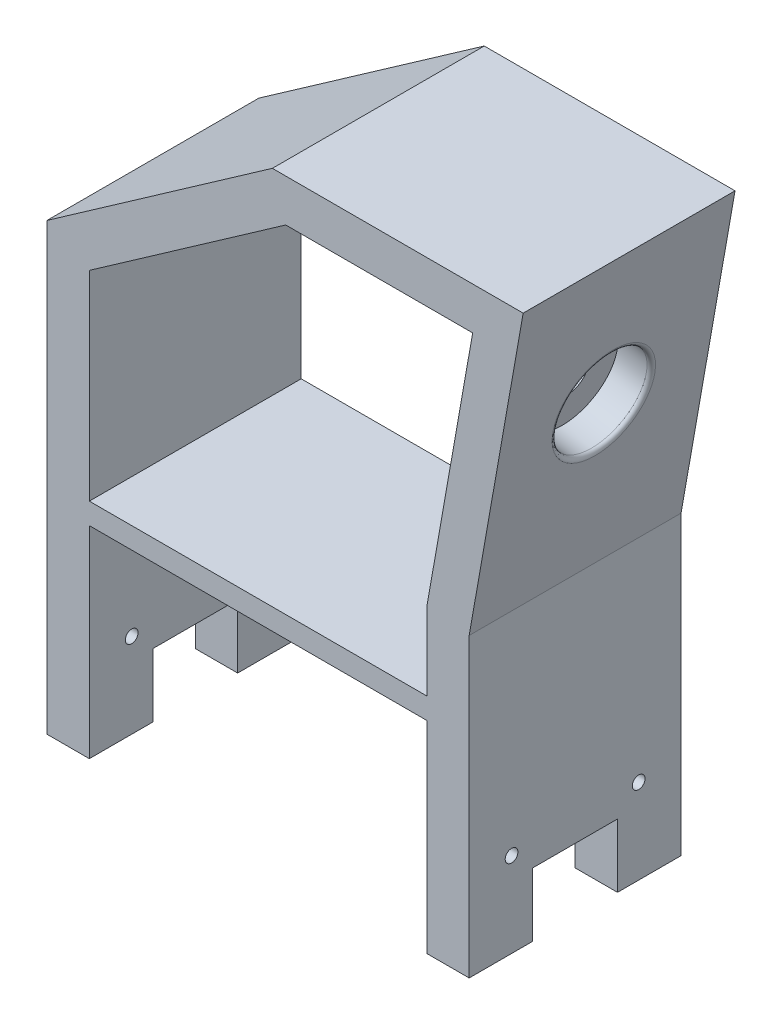
ISO-10303-21;
HEADER;
FILE_DESCRIPTION(('STEP AP214'),'2;1');
FILE_NAME('part.step','',(''),(''),'','','');
FILE_SCHEMA(('AUTOMOTIVE_DESIGN { 1 0 10303 214 1 1 1 1 }'));
ENDSEC;
DATA;
#1=APPLICATION_CONTEXT('core data for automotive mechanical design processes');
#2=APPLICATION_PROTOCOL_DEFINITION('international standard','automotive_design',2000,#1);
#3=PRODUCT_CONTEXT('',#1,'mechanical');
#4=PRODUCT('Part','Part','',(#3));
#5=PRODUCT_RELATED_PRODUCT_CATEGORY('part','',(#4));
#6=PRODUCT_DEFINITION_FORMATION('','',#4);
#7=PRODUCT_DEFINITION_CONTEXT('part definition',#1,'design');
#8=PRODUCT_DEFINITION('design','',#6,#7);
#9=PRODUCT_DEFINITION_SHAPE('','',#8);
#10=(LENGTH_UNIT() NAMED_UNIT(*) SI_UNIT(.MILLI.,.METRE.));
#11=(NAMED_UNIT(*) PLANE_ANGLE_UNIT() SI_UNIT($,.RADIAN.));
#12=(NAMED_UNIT(*) SI_UNIT($,.STERADIAN.) SOLID_ANGLE_UNIT());
#13=UNCERTAINTY_MEASURE_WITH_UNIT(LENGTH_MEASURE(1.E-05),#10,'distance_accuracy_value','');
#14=(GEOMETRIC_REPRESENTATION_CONTEXT(3) GLOBAL_UNCERTAINTY_ASSIGNED_CONTEXT((#13)) GLOBAL_UNIT_ASSIGNED_CONTEXT((#10,
#11,#12)) REPRESENTATION_CONTEXT('',''));
#15=CARTESIAN_POINT('',(0.,0.,0.));
#16=DIRECTION('',(0.,0.,1.));
#17=DIRECTION('',(1.,0.,0.));
#18=AXIS2_PLACEMENT_3D('',#15,#16,#17);
#19=CARTESIAN_POINT('',(71.8800104345077,105.,35.));
#20=DIRECTION('',(0.,-1.,0.));
#21=DIRECTION('',(1.,0.,0.));
#22=AXIS2_PLACEMENT_3D('',#19,#20,#21);
#23=PLANE('',#22);
#24=DIRECTION('',(0.,0.,-1.));
#25=VECTOR('',#24,1.);
#26=CARTESIAN_POINT('',(-30.5064857593433,105.,50.));
#27=LINE('',#26,#25);
#28=CARTESIAN_POINT('',(-30.5064857593433,105.,50.));
#29=VERTEX_POINT('',#28);
#30=CARTESIAN_POINT('',(-30.5064857593433,105.,35.));
#31=VERTEX_POINT('',#30);
#32=EDGE_CURVE('E357',#29,#31,#27,.T.);
#33=ORIENTED_EDGE('',*,*,#32,.F.);
#34=DIRECTION('',(1.,0.,0.));
#35=VECTOR('',#34,1.);
#36=CARTESIAN_POINT('',(0.,105.,50.));
#37=LINE('',#36,#35);
#38=CARTESIAN_POINT('',(-40.5064857593433,105.,50.));
#39=VERTEX_POINT('',#38);
#40=EDGE_CURVE('E356',#39,#29,#37,.T.);
#41=ORIENTED_EDGE('',*,*,#40,.F.);
#42=DIRECTION('',(0.,0.,-1.));
#43=VECTOR('',#42,1.);
#44=CARTESIAN_POINT('',(-40.5064857593433,105.,50.));
#45=LINE('',#44,#43);
#46=CARTESIAN_POINT('',(-40.5064857593433,105.,35.));
#47=VERTEX_POINT('',#46);
#48=EDGE_CURVE('E233',#39,#47,#45,.T.);
#49=ORIENTED_EDGE('',*,*,#48,.T.);
#50=DIRECTION('',(-1.,0.,0.));
#51=VECTOR('',#50,1.);
#52=CARTESIAN_POINT('',(71.8800104345077,105.,35.));
#53=LINE('',#52,#51);
#54=EDGE_CURVE('E11',#31,#47,#53,.T.);
#55=ORIENTED_EDGE('',*,*,#54,.F.);
#56=EDGE_LOOP('',(#33,#41,#49,#55));
#57=FACE_BOUND('',#56,.T.);
#58=ADVANCED_FACE('F40',(#57),#23,.T.);
#59=CARTESIAN_POINT('',(71.8800104345077,120.,35.));
#60=DIRECTION('',(0.,0.,-1.));
#61=DIRECTION('',(-1.,0.,0.));
#62=AXIS2_PLACEMENT_3D('',#59,#60,#61);
#63=PLANE('',#62);
#64=DIRECTION('',(0.,1.,0.));
#65=VECTOR('',#64,1.);
#66=CARTESIAN_POINT('',(-30.5064857593433,204.794329494483,35.));
#67=LINE('',#66,#65);
#68=CARTESIAN_POINT('',(-30.5064857593433,120.,35.));
#69=VERTEX_POINT('',#68);
#70=EDGE_CURVE('E360',#31,#69,#67,.T.);
#71=ORIENTED_EDGE('',*,*,#70,.F.);
#72=ORIENTED_EDGE('',*,*,#54,.T.);
#73=DIRECTION('',(0.,1.,0.));
#74=VECTOR('',#73,1.);
#75=CARTESIAN_POINT('',(-40.5064857593433,210.,35.));
#76=LINE('',#75,#74);
#77=CARTESIAN_POINT('',(-40.5064857593433,120.,35.));
#78=VERTEX_POINT('',#77);
#79=EDGE_CURVE('E236',#47,#78,#76,.T.);
#80=ORIENTED_EDGE('',*,*,#79,.T.);
#81=DIRECTION('',(-1.,0.,0.));
#82=VECTOR('',#81,1.);
#83=CARTESIAN_POINT('',(71.8800104345077,120.,35.));
#84=LINE('',#83,#82);
#85=EDGE_CURVE('E344',#69,#78,#84,.T.);
#86=ORIENTED_EDGE('',*,*,#85,.F.);
#87=EDGE_LOOP('',(#71,#72,#80,#86));
#88=FACE_BOUND('',#87,.T.);
#89=ADVANCED_FACE('F397',(#88),#63,.T.);
#90=CARTESIAN_POINT('',(71.8800104345077,120.,15.));
#91=DIRECTION('',(0.,-1.,0.));
#92=DIRECTION('',(1.,0.,0.));
#93=AXIS2_PLACEMENT_3D('',#90,#91,#92);
#94=PLANE('',#93);
#95=DIRECTION('',(0.,0.,-1.));
#96=VECTOR('',#95,1.);
#97=CARTESIAN_POINT('',(-30.5064857593433,120.,50.));
#98=LINE('',#97,#96);
#99=CARTESIAN_POINT('',(-30.5064857593433,120.,15.));
#100=VERTEX_POINT('',#99);
#101=EDGE_CURVE('E363',#69,#100,#98,.T.);
#102=ORIENTED_EDGE('',*,*,#101,.F.);
#103=ORIENTED_EDGE('',*,*,#85,.T.);
#104=DIRECTION('',(0.,0.,-1.));
#105=VECTOR('',#104,1.);
#106=CARTESIAN_POINT('',(-40.5064857593433,120.,50.));
#107=LINE('',#106,#105);
#108=CARTESIAN_POINT('',(-40.5064857593433,120.,15.));
#109=VERTEX_POINT('',#108);
#110=EDGE_CURVE('E390',#78,#109,#107,.T.);
#111=ORIENTED_EDGE('',*,*,#110,.T.);
#112=DIRECTION('',(-1.,0.,0.));
#113=VECTOR('',#112,1.);
#114=CARTESIAN_POINT('',(71.8800104345077,120.,15.));
#115=LINE('',#114,#113);
#116=EDGE_CURVE('E347',#100,#109,#115,.T.);
#117=ORIENTED_EDGE('',*,*,#116,.F.);
#118=EDGE_LOOP('',(#102,#103,#111,#117));
#119=FACE_BOUND('',#118,.T.);
#120=ADVANCED_FACE('F404',(#119),#94,.T.);
#121=CARTESIAN_POINT('',(71.8800104345077,105.,15.));
#122=DIRECTION('',(0.,0.,1.));
#123=DIRECTION('',(1.,0.,0.));
#124=AXIS2_PLACEMENT_3D('',#121,#122,#123);
#125=PLANE('',#124);
#126=DIRECTION('',(0.,-1.,0.));
#127=VECTOR('',#126,1.);
#128=CARTESIAN_POINT('',(-30.5064857593433,204.794329494483,15.));
#129=LINE('',#128,#127);
#130=CARTESIAN_POINT('',(-30.5064857593433,105.,15.));
#131=VERTEX_POINT('',#130);
#132=EDGE_CURVE('E366',#100,#131,#129,.T.);
#133=ORIENTED_EDGE('',*,*,#132,.F.);
#134=ORIENTED_EDGE('',*,*,#116,.T.);
#135=DIRECTION('',(0.,-1.,0.));
#136=VECTOR('',#135,1.);
#137=CARTESIAN_POINT('',(-40.5064857593433,210.,15.));
#138=LINE('',#137,#136);
#139=CARTESIAN_POINT('',(-40.5064857593433,105.,15.));
#140=VERTEX_POINT('',#139);
#141=EDGE_CURVE('E387',#109,#140,#138,.T.);
#142=ORIENTED_EDGE('',*,*,#141,.T.);
#143=DIRECTION('',(-1.,0.,0.));
#144=VECTOR('',#143,1.);
#145=CARTESIAN_POINT('',(71.8800104345077,105.,15.));
#146=LINE('',#145,#144);
#147=EDGE_CURVE('E350',#131,#140,#146,.T.);
#148=ORIENTED_EDGE('',*,*,#147,.F.);
#149=EDGE_LOOP('',(#133,#134,#142,#148));
#150=FACE_BOUND('',#149,.T.);
#151=ADVANCED_FACE('F410',(#150),#125,.T.);
#152=CARTESIAN_POINT('',(71.8800104345077,105.,0.));
#153=DIRECTION('',(0.,-1.,0.));
#154=DIRECTION('',(1.,0.,0.));
#155=AXIS2_PLACEMENT_3D('',#152,#153,#154);
#156=PLANE('',#155);
#157=DIRECTION('',(0.,0.,-1.));
#158=VECTOR('',#157,1.);
#159=CARTESIAN_POINT('',(-30.5064857593433,105.,50.));
#160=LINE('',#159,#158);
#161=CARTESIAN_POINT('',(-30.5064857593433,105.,0.));
#162=VERTEX_POINT('',#161);
#163=EDGE_CURVE('E369',#131,#162,#160,.T.);
#164=ORIENTED_EDGE('',*,*,#163,.F.);
#165=ORIENTED_EDGE('',*,*,#147,.T.);
#166=DIRECTION('',(0.,0.,-1.));
#167=VECTOR('',#166,1.);
#168=CARTESIAN_POINT('',(-40.5064857593433,105.,50.));
#169=LINE('',#168,#167);
#170=CARTESIAN_POINT('',(-40.5064857593433,105.,0.));
#171=VERTEX_POINT('',#170);
#172=EDGE_CURVE('E226',#140,#171,#169,.T.);
#173=ORIENTED_EDGE('',*,*,#172,.T.);
#174=DIRECTION('',(1.,0.,0.));
#175=VECTOR('',#174,1.);
#176=CARTESIAN_POINT('',(0.,105.,0.));
#177=LINE('',#176,#175);
#178=EDGE_CURVE('E225',#171,#162,#177,.T.);
#179=ORIENTED_EDGE('',*,*,#178,.T.);
#180=EDGE_LOOP('',(#164,#165,#173,#179));
#181=FACE_BOUND('',#180,.T.);
#182=ADVANCED_FACE('F412',(#181),#156,.T.);
#183=DIRECTION('',(0.,0.,1.));
#184=VECTOR('',#183,1.);
#185=CARTESIAN_POINT('',(49.130974017595,105.,50.));
#186=LINE('',#185,#184);
#187=CARTESIAN_POINT('',(49.130974017595,105.,35.));
#188=VERTEX_POINT('',#187);
#189=CARTESIAN_POINT('',(49.130974017595,105.,50.));
#190=VERTEX_POINT('',#189);
#191=EDGE_CURVE('E372',#188,#190,#186,.T.);
#192=ORIENTED_EDGE('',*,*,#191,.F.);
#193=CARTESIAN_POINT('',(59.130974017595,105.,35.));
#194=VERTEX_POINT('',#193);
#195=EDGE_CURVE('E49',#194,#188,#53,.T.);
#196=ORIENTED_EDGE('',*,*,#195,.F.);
#197=DIRECTION('',(0.,0.,1.));
#198=VECTOR('',#197,1.);
#199=CARTESIAN_POINT('',(59.130974017595,105.,50.));
#200=LINE('',#199,#198);
#201=CARTESIAN_POINT('',(59.130974017595,105.,50.));
#202=VERTEX_POINT('',#201);
#203=EDGE_CURVE('E247',#194,#202,#200,.T.);
#204=ORIENTED_EDGE('',*,*,#203,.T.);
#205=EDGE_CURVE('E352',#190,#202,#37,.T.);
#206=ORIENTED_EDGE('',*,*,#205,.F.);
#207=EDGE_LOOP('',(#192,#196,#204,#206));
#208=FACE_BOUND('',#207,.T.);
#209=ADVANCED_FACE('F427',(#208),#23,.T.);
#210=DIRECTION('',(0.,-1.,0.));
#211=VECTOR('',#210,1.);
#212=CARTESIAN_POINT('',(49.130974017595,10.,35.));
#213=LINE('',#212,#211);
#214=CARTESIAN_POINT('',(49.130974017595,120.,35.));
#215=VERTEX_POINT('',#214);
#216=EDGE_CURVE('E375',#215,#188,#213,.T.);
#217=ORIENTED_EDGE('',*,*,#216,.F.);
#218=CARTESIAN_POINT('',(59.130974017595,120.,35.));
#219=VERTEX_POINT('',#218);
#220=EDGE_CURVE('E346',#219,#215,#84,.T.);
#221=ORIENTED_EDGE('',*,*,#220,.F.);
#222=DIRECTION('',(0.,-1.,0.));
#223=VECTOR('',#222,1.);
#224=CARTESIAN_POINT('',(59.130974017595,0.,35.));
#225=LINE('',#224,#223);
#226=EDGE_CURVE('E244',#219,#194,#225,.T.);
#227=ORIENTED_EDGE('',*,*,#226,.T.);
#228=ORIENTED_EDGE('',*,*,#195,.T.);
#229=EDGE_LOOP('',(#217,#221,#227,#228));
#230=FACE_BOUND('',#229,.T.);
#231=ADVANCED_FACE('F431',(#230),#63,.T.);
#232=DIRECTION('',(0.,0.,1.));
#233=VECTOR('',#232,1.);
#234=CARTESIAN_POINT('',(49.130974017595,120.,50.));
#235=LINE('',#234,#233);
#236=CARTESIAN_POINT('',(49.130974017595,120.,15.));
#237=VERTEX_POINT('',#236);
#238=EDGE_CURVE('E378',#237,#215,#235,.T.);
#239=ORIENTED_EDGE('',*,*,#238,.F.);
#240=CARTESIAN_POINT('',(59.130974017595,120.,15.));
#241=VERTEX_POINT('',#240);
#242=EDGE_CURVE('E349',#241,#237,#115,.T.);
#243=ORIENTED_EDGE('',*,*,#242,.F.);
#244=DIRECTION('',(0.,0.,1.));
#245=VECTOR('',#244,1.);
#246=CARTESIAN_POINT('',(59.130974017595,120.,50.));
#247=LINE('',#246,#245);
#248=EDGE_CURVE('E238',#241,#219,#247,.T.);
#249=ORIENTED_EDGE('',*,*,#248,.T.);
#250=ORIENTED_EDGE('',*,*,#220,.T.);
#251=EDGE_LOOP('',(#239,#243,#249,#250));
#252=FACE_BOUND('',#251,.T.);
#253=ADVANCED_FACE('F434',(#252),#94,.T.);
#254=DIRECTION('',(0.,1.,0.));
#255=VECTOR('',#254,1.);
#256=CARTESIAN_POINT('',(49.130974017595,10.,15.));
#257=LINE('',#256,#255);
#258=CARTESIAN_POINT('',(49.130974017595,105.,15.));
#259=VERTEX_POINT('',#258);
#260=EDGE_CURVE('E381',#259,#237,#257,.T.);
#261=ORIENTED_EDGE('',*,*,#260,.F.);
#262=CARTESIAN_POINT('',(59.130974017595,105.,15.));
#263=VERTEX_POINT('',#262);
#264=EDGE_CURVE('E342',#263,#259,#146,.T.);
#265=ORIENTED_EDGE('',*,*,#264,.F.);
#266=DIRECTION('',(0.,1.,0.));
#267=VECTOR('',#266,1.);
#268=CARTESIAN_POINT('',(59.130974017595,0.,15.));
#269=LINE('',#268,#267);
#270=EDGE_CURVE('E232',#263,#241,#269,.T.);
#271=ORIENTED_EDGE('',*,*,#270,.T.);
#272=ORIENTED_EDGE('',*,*,#242,.T.);
#273=EDGE_LOOP('',(#261,#265,#271,#272));
#274=FACE_BOUND('',#273,.T.);
#275=ADVANCED_FACE('F437',(#274),#125,.T.);
#276=DIRECTION('',(0.,0.,1.));
#277=VECTOR('',#276,1.);
#278=CARTESIAN_POINT('',(49.130974017595,105.,50.));
#279=LINE('',#278,#277);
#280=CARTESIAN_POINT('',(49.130974017595,105.,0.));
#281=VERTEX_POINT('',#280);
#282=EDGE_CURVE('E224',#281,#259,#279,.T.);
#283=ORIENTED_EDGE('',*,*,#282,.F.);
#284=CARTESIAN_POINT('',(59.130974017595,105.,0.));
#285=VERTEX_POINT('',#284);
#286=EDGE_CURVE('E208',#281,#285,#177,.T.);
#287=ORIENTED_EDGE('',*,*,#286,.T.);
#288=DIRECTION('',(0.,0.,1.));
#289=VECTOR('',#288,1.);
#290=CARTESIAN_POINT('',(59.130974017595,105.,50.));
#291=LINE('',#290,#289);
#292=EDGE_CURVE('E222',#285,#263,#291,.T.);
#293=ORIENTED_EDGE('',*,*,#292,.T.);
#294=ORIENTED_EDGE('',*,*,#264,.T.);
#295=EDGE_LOOP('',(#283,#287,#293,#294));
#296=FACE_BOUND('',#295,.T.);
#297=ADVANCED_FACE('F221',(#296),#156,.T.);
#298=CARTESIAN_POINT('',(49.130974017595,10.,50.));
#299=DIRECTION('',(-1.,0.,0.));
#300=DIRECTION('',(0.,0.,1.));
#301=AXIS2_PLACEMENT_3D('',#298,#299,#300);
#302=PLANE('',#301);
#303=CARTESIAN_POINT('',(49.130974017595,125.,40.));
#304=DIRECTION('',(-1.,0.,0.));
#305=DIRECTION('',(0.,0.,1.));
#306=AXIS2_PLACEMENT_3D('',#303,#304,#305);
#307=CIRCLE('',#306,1.5);
#308=CARTESIAN_POINT('',(49.130974017595,125.,41.5));
#309=VERTEX_POINT('',#308);
#310=EDGE_CURVE('E330',#309,#309,#307,.T.);
#311=ORIENTED_EDGE('',*,*,#310,.F.);
#312=EDGE_LOOP('',(#311));
#313=FACE_BOUND('',#312,.T.);
#314=CARTESIAN_POINT('',(49.130974017595,125.,10.));
#315=DIRECTION('',(-1.,0.,0.));
#316=DIRECTION('',(0.,0.,1.));
#317=AXIS2_PLACEMENT_3D('',#314,#315,#316);
#318=CIRCLE('',#317,1.5);
#319=CARTESIAN_POINT('',(49.130974017595,125.,11.5));
#320=VERTEX_POINT('',#319);
#321=EDGE_CURVE('E323',#320,#320,#318,.T.);
#322=ORIENTED_EDGE('',*,*,#321,.F.);
#323=EDGE_LOOP('',(#322));
#324=FACE_BOUND('',#323,.T.);
#325=DIRECTION('',(0.,1.,0.));
#326=VECTOR('',#325,1.);
#327=CARTESIAN_POINT('',(49.130974017595,10.,0.));
#328=LINE('',#327,#326);
#329=CARTESIAN_POINT('',(49.130974017595,152.635730725864,0.));
#330=VERTEX_POINT('',#329);
#331=EDGE_CURVE('E44',#281,#330,#328,.T.);
#332=ORIENTED_EDGE('',*,*,#331,.F.);
#333=ORIENTED_EDGE('',*,*,#282,.T.);
#334=ORIENTED_EDGE('',*,*,#260,.T.);
#335=ORIENTED_EDGE('',*,*,#238,.T.);
#336=ORIENTED_EDGE('',*,*,#216,.T.);
#337=ORIENTED_EDGE('',*,*,#191,.T.);
#338=DIRECTION('',(0.,1.,0.));
#339=VECTOR('',#338,1.);
#340=CARTESIAN_POINT('',(49.130974017595,10.,50.));
#341=LINE('',#340,#339);
#342=CARTESIAN_POINT('',(49.130974017595,152.635730725864,50.));
#343=VERTEX_POINT('',#342);
#344=EDGE_CURVE('E261',#190,#343,#341,.T.);
#345=ORIENTED_EDGE('',*,*,#344,.T.);
#346=DIRECTION('',(0.,0.,1.));
#347=VECTOR('',#346,1.);
#348=CARTESIAN_POINT('',(49.1309740175949,152.635730725864,0.));
#349=LINE('',#348,#347);
#350=EDGE_CURVE('E300',#330,#343,#349,.T.);
#351=ORIENTED_EDGE('',*,*,#350,.F.);
#352=EDGE_LOOP('',(#332,#333,#334,#335,#336,#337,#345,#351));
#353=FACE_BOUND('',#352,.T.);
#354=ADVANCED_FACE('F421',(#313,#324,#353),#302,.T.);
#355=CARTESIAN_POINT('',(-30.5064857593433,204.794329494483,50.));
#356=DIRECTION('',(1.,0.,0.));
#357=DIRECTION('',(0.,0.,-1.));
#358=AXIS2_PLACEMENT_3D('',#355,#356,#357);
#359=PLANE('',#358);
#360=CARTESIAN_POINT('',(-30.5064857593433,125.,40.));
#361=DIRECTION('',(1.,0.,0.));
#362=DIRECTION('',(0.,0.,-1.));
#363=AXIS2_PLACEMENT_3D('',#360,#361,#362);
#364=CIRCLE('',#363,1.5);
#365=CARTESIAN_POINT('',(-30.5064857593433,125.,38.5));
#366=VERTEX_POINT('',#365);
#367=EDGE_CURVE('E333',#366,#366,#364,.T.);
#368=ORIENTED_EDGE('',*,*,#367,.F.);
#369=EDGE_LOOP('',(#368));
#370=FACE_BOUND('',#369,.T.);
#371=CARTESIAN_POINT('',(-30.5064857593433,125.,10.));
#372=DIRECTION('',(1.,0.,0.));
#373=DIRECTION('',(0.,0.,-1.));
#374=AXIS2_PLACEMENT_3D('',#371,#372,#373);
#375=CIRCLE('',#374,1.5);
#376=CARTESIAN_POINT('',(-30.5064857593433,125.,8.5));
#377=VERTEX_POINT('',#376);
#378=EDGE_CURVE('E326',#377,#377,#375,.T.);
#379=ORIENTED_EDGE('',*,*,#378,.F.);
#380=EDGE_LOOP('',(#379));
#381=FACE_BOUND('',#380,.T.);
#382=ORIENTED_EDGE('',*,*,#132,.T.);
#383=ORIENTED_EDGE('',*,*,#163,.T.);
#384=DIRECTION('',(0.,-1.,0.));
#385=VECTOR('',#384,1.);
#386=CARTESIAN_POINT('',(-30.5064857593433,204.794329494483,0.));
#387=LINE('',#386,#385);
#388=CARTESIAN_POINT('',(-30.5064857593433,152.635730725864,0.));
#389=VERTEX_POINT('',#388);
#390=EDGE_CURVE('E265',#389,#162,#387,.T.);
#391=ORIENTED_EDGE('',*,*,#390,.F.);
#392=DIRECTION('',(0.,0.,1.));
#393=VECTOR('',#392,1.);
#394=CARTESIAN_POINT('',(-30.5064857593433,152.635730725864,0.));
#395=LINE('',#394,#393);
#396=CARTESIAN_POINT('',(-30.5064857593433,152.635730725864,50.));
#397=VERTEX_POINT('',#396);
#398=EDGE_CURVE('E297',#389,#397,#395,.T.);
#399=ORIENTED_EDGE('',*,*,#398,.T.);
#400=DIRECTION('',(0.,-1.,0.));
#401=VECTOR('',#400,1.);
#402=CARTESIAN_POINT('',(-30.5064857593433,204.794329494483,50.));
#403=LINE('',#402,#401);
#404=EDGE_CURVE('E57',#397,#29,#403,.T.);
#405=ORIENTED_EDGE('',*,*,#404,.T.);
#406=ORIENTED_EDGE('',*,*,#32,.T.);
#407=ORIENTED_EDGE('',*,*,#70,.T.);
#408=ORIENTED_EDGE('',*,*,#101,.T.);
#409=EDGE_LOOP('',(#382,#383,#391,#399,#405,#406,#407,#408));
#410=FACE_BOUND('',#409,.T.);
#411=ADVANCED_FACE('F407',(#370,#381,#410),#359,.T.);
#412=CARTESIAN_POINT('',(0.,0.,50.));
#413=DIRECTION('',(0.,0.,1.));
#414=DIRECTION('',(1.,0.,0.));
#415=AXIS2_PLACEMENT_3D('',#412,#413,#414);
#416=PLANE('',#415);
#417=CARTESIAN_POINT('',(49.130974017595,157.635730725864,50.));
#418=VERTEX_POINT('',#417);
#419=CARTESIAN_POINT('',(49.130974017595,175.874886635259,50.));
#420=VERTEX_POINT('',#419);
#421=EDGE_CURVE('E65',#418,#420,#341,.T.);
#422=ORIENTED_EDGE('',*,*,#421,.F.);
#423=DIRECTION('',(-1.,0.,0.));
#424=VECTOR('',#423,1.);
#425=CARTESIAN_POINT('',(-30.5064857593433,157.635730725864,50.));
#426=LINE('',#425,#424);
#427=CARTESIAN_POINT('',(-30.5064857593433,157.635730725864,50.));
#428=VERTEX_POINT('',#427);
#429=EDGE_CURVE('E308',#418,#428,#426,.T.);
#430=ORIENTED_EDGE('',*,*,#429,.T.);
#431=CARTESIAN_POINT('',(-30.5064857593433,204.794329494483,50.));
#432=VERTEX_POINT('',#431);
#433=EDGE_CURVE('E258',#432,#428,#403,.T.);
#434=ORIENTED_EDGE('',*,*,#433,.F.);
#435=DIRECTION('',(-0.819152044288993,-0.573576436351044,0.));
#436=VECTOR('',#435,1.);
#437=CARTESIAN_POINT('',(15.8402534076994,237.246665630685,50.));
#438=LINE('',#437,#436);
#439=CARTESIAN_POINT('',(15.8402534076994,237.246665630685,50.));
#440=VERTEX_POINT('',#439);
#441=EDGE_CURVE('E293',#440,#432,#438,.T.);
#442=ORIENTED_EDGE('',*,*,#441,.F.);
#443=DIRECTION('',(-1.,0.,0.));
#444=VECTOR('',#443,1.);
#445=CARTESIAN_POINT('',(59.9524745085656,237.246665630685,50.));
#446=LINE('',#445,#444);
#447=CARTESIAN_POINT('',(59.9524745085656,237.246665630685,50.));
#448=VERTEX_POINT('',#447);
#449=EDGE_CURVE('E291',#448,#440,#446,.T.);
#450=ORIENTED_EDGE('',*,*,#449,.F.);
#451=DIRECTION('',(0.17364817766693,0.984807753012208,0.));
#452=VECTOR('',#451,1.);
#453=CARTESIAN_POINT('',(49.130974017595,175.874886635259,50.));
#454=LINE('',#453,#452);
#455=EDGE_CURVE('E262',#420,#448,#454,.T.);
#456=ORIENTED_EDGE('',*,*,#455,.F.);
#457=EDGE_LOOP('',(#422,#430,#434,#442,#450,#456));
#458=FACE_BOUND('',#457,.T.);
#459=DIRECTION('',(0.,-1.,0.));
#460=VECTOR('',#459,1.);
#461=CARTESIAN_POINT('',(-40.5064857593433,210.,50.));
#462=LINE('',#461,#460);
#463=CARTESIAN_POINT('',(-40.5064857593433,210.,50.));
#464=VERTEX_POINT('',#463);
#465=EDGE_CURVE('E252',#464,#39,#462,.T.);
#466=ORIENTED_EDGE('',*,*,#465,.T.);
#467=ORIENTED_EDGE('',*,*,#40,.T.);
#468=ORIENTED_EDGE('',*,*,#404,.F.);
#469=DIRECTION('',(1.,0.,0.));
#470=VECTOR('',#469,1.);
#471=CARTESIAN_POINT('',(49.1309740175949,152.635730725864,50.));
#472=LINE('',#471,#470);
#473=EDGE_CURVE('E310',#397,#343,#472,.T.);
#474=ORIENTED_EDGE('',*,*,#473,.T.);
#475=ORIENTED_EDGE('',*,*,#344,.F.);
#476=ORIENTED_EDGE('',*,*,#205,.T.);
#477=DIRECTION('',(0.,1.,0.));
#478=VECTOR('',#477,1.);
#479=CARTESIAN_POINT('',(59.130974017595,0.,50.));
#480=LINE('',#479,#478);
#481=CARTESIAN_POINT('',(59.130974017595,175.,50.));
#482=VERTEX_POINT('',#481);
#483=EDGE_CURVE('E250',#202,#482,#480,.T.);
#484=ORIENTED_EDGE('',*,*,#483,.T.);
#485=DIRECTION('',(0.17364817766693,0.984807753012208,0.));
#486=VECTOR('',#485,1.);
#487=CARTESIAN_POINT('',(59.130974017595,175.,50.));
#488=LINE('',#487,#486);
#489=CARTESIAN_POINT('',(71.8700104345077,247.246665630685,50.));
#490=VERTEX_POINT('',#489);
#491=EDGE_CURVE('E216',#482,#490,#488,.T.);
#492=ORIENTED_EDGE('',*,*,#491,.T.);
#493=DIRECTION('',(-1.,0.,0.));
#494=VECTOR('',#493,1.);
#495=CARTESIAN_POINT('',(71.8700104345077,247.246665630685,50.));
#496=LINE('',#495,#494);
#497=CARTESIAN_POINT('',(12.6872655189098,247.246665630685,50.));
#498=VERTEX_POINT('',#497);
#499=EDGE_CURVE('E840',#490,#498,#496,.T.);
#500=ORIENTED_EDGE('',*,*,#499,.T.);
#501=DIRECTION('',(-0.819152044288993,-0.573576436351044,0.));
#502=VECTOR('',#501,1.);
#503=CARTESIAN_POINT('',(12.6872655189098,247.246665630685,50.));
#504=LINE('',#503,#502);
#505=EDGE_CURVE('E254',#498,#464,#504,.T.);
#506=ORIENTED_EDGE('',*,*,#505,.T.);
#507=EDGE_LOOP('',(#466,#467,#468,#474,#475,#476,#484,#492,#500,#506));
#508=FACE_BOUND('',#507,.T.);
#509=ADVANCED_FACE('F289',(#458,#508),#416,.T.);
#510=CARTESIAN_POINT('',(0.,0.,0.));
#511=DIRECTION('',(0.,0.,1.));
#512=DIRECTION('',(1.,0.,0.));
#513=AXIS2_PLACEMENT_3D('',#510,#511,#512);
#514=PLANE('',#513);
#515=DIRECTION('',(-1.,0.,0.));
#516=VECTOR('',#515,1.);
#517=CARTESIAN_POINT('',(-30.5064857593433,157.635730725864,0.));
#518=LINE('',#517,#516);
#519=CARTESIAN_POINT('',(49.130974017595,157.635730725864,0.));
#520=VERTEX_POINT('',#519);
#521=CARTESIAN_POINT('',(-30.5064857593433,157.635730725864,0.));
#522=VERTEX_POINT('',#521);
#523=EDGE_CURVE('E299',#520,#522,#518,.T.);
#524=ORIENTED_EDGE('',*,*,#523,.F.);
#525=CARTESIAN_POINT('',(49.130974017595,175.874886635259,0.));
#526=VERTEX_POINT('',#525);
#527=EDGE_CURVE('E307',#520,#526,#328,.T.);
#528=ORIENTED_EDGE('',*,*,#527,.T.);
#529=DIRECTION('',(0.17364817766693,0.984807753012208,0.));
#530=VECTOR('',#529,1.);
#531=CARTESIAN_POINT('',(49.130974017595,175.874886635259,0.));
#532=LINE('',#531,#530);
#533=CARTESIAN_POINT('',(59.9524745085656,237.246665630685,0.));
#534=VERTEX_POINT('',#533);
#535=EDGE_CURVE('E285',#526,#534,#532,.T.);
#536=ORIENTED_EDGE('',*,*,#535,.T.);
#537=DIRECTION('',(-1.,0.,0.));
#538=VECTOR('',#537,1.);
#539=CARTESIAN_POINT('',(59.9524745085656,237.246665630685,0.));
#540=LINE('',#539,#538);
#541=CARTESIAN_POINT('',(15.8402534076994,237.246665630685,0.));
#542=VERTEX_POINT('',#541);
#543=EDGE_CURVE('E828',#534,#542,#540,.T.);
#544=ORIENTED_EDGE('',*,*,#543,.T.);
#545=DIRECTION('',(-0.819152044288993,-0.573576436351044,0.));
#546=VECTOR('',#545,1.);
#547=CARTESIAN_POINT('',(15.8402534076994,237.246665630685,0.));
#548=LINE('',#547,#546);
#549=CARTESIAN_POINT('',(-30.5064857593433,204.794329494483,0.));
#550=VERTEX_POINT('',#549);
#551=EDGE_CURVE('E271',#542,#550,#548,.T.);
#552=ORIENTED_EDGE('',*,*,#551,.T.);
#553=EDGE_CURVE('E263',#550,#522,#387,.T.);
#554=ORIENTED_EDGE('',*,*,#553,.T.);
#555=EDGE_LOOP('',(#524,#528,#536,#544,#552,#554));
#556=FACE_BOUND('',#555,.T.);
#557=ORIENTED_EDGE('',*,*,#178,.F.);
#558=DIRECTION('',(0.,-1.,0.));
#559=VECTOR('',#558,1.);
#560=CARTESIAN_POINT('',(-40.5064857593433,210.,0.));
#561=LINE('',#560,#559);
#562=CARTESIAN_POINT('',(-40.5064857593433,210.,0.));
#563=VERTEX_POINT('',#562);
#564=EDGE_CURVE('E215',#563,#171,#561,.T.);
#565=ORIENTED_EDGE('',*,*,#564,.F.);
#566=DIRECTION('',(-0.819152044288993,-0.573576436351044,0.));
#567=VECTOR('',#566,1.);
#568=CARTESIAN_POINT('',(12.6872655189098,247.246665630685,0.));
#569=LINE('',#568,#567);
#570=CARTESIAN_POINT('',(12.6872655189098,247.246665630685,0.));
#571=VERTEX_POINT('',#570);
#572=EDGE_CURVE('E257',#571,#563,#569,.T.);
#573=ORIENTED_EDGE('',*,*,#572,.F.);
#574=DIRECTION('',(-1.,0.,0.));
#575=VECTOR('',#574,1.);
#576=CARTESIAN_POINT('',(71.8700104345077,247.246665630685,0.));
#577=LINE('',#576,#575);
#578=CARTESIAN_POINT('',(71.8700104345077,247.246665630685,0.));
#579=VERTEX_POINT('',#578);
#580=EDGE_CURVE('E853',#579,#571,#577,.T.);
#581=ORIENTED_EDGE('',*,*,#580,.F.);
#582=DIRECTION('',(0.17364817766693,0.984807753012208,0.));
#583=VECTOR('',#582,1.);
#584=CARTESIAN_POINT('',(59.130974017595,175.,0.));
#585=LINE('',#584,#583);
#586=CARTESIAN_POINT('',(59.130974017595,175.,0.));
#587=VERTEX_POINT('',#586);
#588=EDGE_CURVE('E210',#587,#579,#585,.T.);
#589=ORIENTED_EDGE('',*,*,#588,.F.);
#590=DIRECTION('',(0.,1.,0.));
#591=VECTOR('',#590,1.);
#592=CARTESIAN_POINT('',(59.130974017595,0.,0.));
#593=LINE('',#592,#591);
#594=EDGE_CURVE('E204',#285,#587,#593,.T.);
#595=ORIENTED_EDGE('',*,*,#594,.F.);
#596=ORIENTED_EDGE('',*,*,#286,.F.);
#597=ORIENTED_EDGE('',*,*,#331,.T.);
#598=DIRECTION('',(1.,0.,0.));
#599=VECTOR('',#598,1.);
#600=CARTESIAN_POINT('',(49.1309740175949,152.635730725864,0.));
#601=LINE('',#600,#599);
#602=EDGE_CURVE('E311',#389,#330,#601,.T.);
#603=ORIENTED_EDGE('',*,*,#602,.F.);
#604=ORIENTED_EDGE('',*,*,#390,.T.);
#605=EDGE_LOOP('',(#557,#565,#573,#581,#589,#595,#596,#597,#603,#604));
#606=FACE_BOUND('',#605,.T.);
#607=ADVANCED_FACE('F207',(#556,#606),#514,.F.);
#608=CARTESIAN_POINT('',(-40.5064857593433,210.,50.));
#609=DIRECTION('',(1.,0.,0.));
#610=DIRECTION('',(0.,1.,0.));
#611=AXIS2_PLACEMENT_3D('',#608,#609,#610);
#612=PLANE('',#611);
#613=CARTESIAN_POINT('',(-40.5064857593433,125.,40.));
#614=DIRECTION('',(-1.,0.,0.));
#615=DIRECTION('',(0.,-1.,0.));
#616=AXIS2_PLACEMENT_3D('',#613,#614,#615);
#617=CIRCLE('',#616,1.5);
#618=CARTESIAN_POINT('',(-40.5064857593433,123.5,40.));
#619=VERTEX_POINT('',#618);
#620=EDGE_CURVE('E337',#619,#619,#617,.T.);
#621=ORIENTED_EDGE('',*,*,#620,.F.);
#622=EDGE_LOOP('',(#621));
#623=FACE_BOUND('',#622,.T.);
#624=CARTESIAN_POINT('',(-40.5064857593433,125.,10.));
#625=DIRECTION('',(-1.,0.,0.));
#626=DIRECTION('',(0.,1.,0.));
#627=AXIS2_PLACEMENT_3D('',#624,#625,#626);
#628=CIRCLE('',#627,1.5);
#629=CARTESIAN_POINT('',(-40.5064857593433,126.5,10.));
#630=VERTEX_POINT('',#629);
#631=EDGE_CURVE('E340',#630,#630,#628,.T.);
#632=ORIENTED_EDGE('',*,*,#631,.F.);
#633=EDGE_LOOP('',(#632));
#634=FACE_BOUND('',#633,.T.);
#635=ORIENTED_EDGE('',*,*,#172,.F.);
#636=ORIENTED_EDGE('',*,*,#141,.F.);
#637=ORIENTED_EDGE('',*,*,#110,.F.);
#638=ORIENTED_EDGE('',*,*,#79,.F.);
#639=ORIENTED_EDGE('',*,*,#48,.F.);
#640=ORIENTED_EDGE('',*,*,#465,.F.);
#641=DIRECTION('',(0.,0.,-1.));
#642=VECTOR('',#641,1.);
#643=CARTESIAN_POINT('',(-40.5064857593433,210.,50.));
#644=LINE('',#643,#642);
#645=EDGE_CURVE('E837',#464,#563,#644,.T.);
#646=ORIENTED_EDGE('',*,*,#645,.T.);
#647=ORIENTED_EDGE('',*,*,#564,.T.);
#648=EDGE_LOOP('',(#635,#636,#637,#638,#639,#640,#646,#647));
#649=FACE_BOUND('',#648,.T.);
#650=ADVANCED_FACE('F42',(#623,#634,#649),#612,.F.);
#651=CARTESIAN_POINT('',(59.130974017595,0.,50.));
#652=DIRECTION('',(-1.,0.,0.));
#653=DIRECTION('',(0.,-1.,0.));
#654=AXIS2_PLACEMENT_3D('',#651,#652,#653);
#655=PLANE('',#654);
#656=CARTESIAN_POINT('',(59.130974017595,125.,40.));
#657=DIRECTION('',(-1.,0.,0.));
#658=DIRECTION('',(0.,-1.,0.));
#659=AXIS2_PLACEMENT_3D('',#656,#657,#658);
#660=CIRCLE('',#659,1.5);
#661=CARTESIAN_POINT('',(59.130974017595,123.5,40.));
#662=VERTEX_POINT('',#661);
#663=EDGE_CURVE('E336',#662,#662,#660,.T.);
#664=ORIENTED_EDGE('',*,*,#663,.T.);
#665=EDGE_LOOP('',(#664));
#666=FACE_BOUND('',#665,.T.);
#667=CARTESIAN_POINT('',(59.130974017595,125.,10.));
#668=DIRECTION('',(-1.,0.,0.));
#669=DIRECTION('',(0.,-1.,0.));
#670=AXIS2_PLACEMENT_3D('',#667,#668,#669);
#671=CIRCLE('',#670,1.5);
#672=CARTESIAN_POINT('',(59.130974017595,123.5,10.));
#673=VERTEX_POINT('',#672);
#674=EDGE_CURVE('E329',#673,#673,#671,.T.);
#675=ORIENTED_EDGE('',*,*,#674,.T.);
#676=EDGE_LOOP('',(#675));
#677=FACE_BOUND('',#676,.T.);
#678=ORIENTED_EDGE('',*,*,#292,.F.);
#679=ORIENTED_EDGE('',*,*,#594,.T.);
#680=DIRECTION('',(0.,0.,-1.));
#681=VECTOR('',#680,1.);
#682=CARTESIAN_POINT('',(59.130974017595,175.,50.));
#683=LINE('',#682,#681);
#684=EDGE_CURVE('E253',#482,#587,#683,.T.);
#685=ORIENTED_EDGE('',*,*,#684,.F.);
#686=ORIENTED_EDGE('',*,*,#483,.F.);
#687=ORIENTED_EDGE('',*,*,#203,.F.);
#688=ORIENTED_EDGE('',*,*,#226,.F.);
#689=ORIENTED_EDGE('',*,*,#248,.F.);
#690=ORIENTED_EDGE('',*,*,#270,.F.);
#691=EDGE_LOOP('',(#678,#679,#685,#686,#687,#688,#689,#690));
#692=FACE_BOUND('',#691,.T.);
#693=ADVANCED_FACE('F229',(#666,#677,#692),#655,.F.);
#694=CARTESIAN_POINT('',(64.9184451935931,213.581150545143,25.));
#695=DIRECTION('',(-0.984807753012208,0.17364817766693,0.));
#696=DIRECTION('',(-0.17364817766693,-0.984807753012208,0.));
#697=AXIS2_PLACEMENT_3D('',#694,#695,#696);
#698=TOROIDAL_SURFACE('',#697,12.025,1.);
#699=CARTESIAN_POINT('',(64.9184451935931,213.581150545143,25.));
#700=DIRECTION('',(-0.984807753012208,0.17364817766693,0.));
#701=DIRECTION('',(-0.17364817766693,-0.984807753012208,0.));
#702=AXIS2_PLACEMENT_3D('',#699,#700,#701);
#703=CIRCLE('',#702,11.025);
#704=CARTESIAN_POINT('',(63.0039740348152,202.723645068184,25.));
#705=VERTEX_POINT('',#704);
#706=EDGE_CURVE('E862',#705,#705,#703,.F.);
#707=ORIENTED_EDGE('',*,*,#706,.F.);
#708=EDGE_LOOP('',(#707));
#709=FACE_BOUND('',#708,.T.);
#710=CARTESIAN_POINT('',(65.9032529466053,213.407502367476,25.));
#711=DIRECTION('',(-0.984807753012208,0.17364817766693,0.));
#712=DIRECTION('',(-0.17364817766693,-0.984807753012208,0.));
#713=AXIS2_PLACEMENT_3D('',#710,#711,#712);
#714=CIRCLE('',#713,12.025);
#715=CARTESIAN_POINT('',(63.8151336101605,201.565189137504,25.));
#716=VERTEX_POINT('',#715);
#717=EDGE_CURVE('E355',#716,#716,#714,.T.);
#718=ORIENTED_EDGE('',*,*,#717,.F.);
#719=EDGE_LOOP('',(#718));
#720=FACE_BOUND('',#719,.T.);
#721=ADVANCED_FACE('F462',(#709,#720),#698,.T.);
#722=DIRECTION('',(0.,0.,1.));
#723=VECTOR('',#722,1.);
#724=CARTESIAN_POINT('',(49.130974017595,157.635730725864,0.));
#725=LINE('',#724,#723);
#726=EDGE_CURVE('E278',#520,#418,#725,.T.);
#727=ORIENTED_EDGE('',*,*,#726,.T.);
#728=ORIENTED_EDGE('',*,*,#421,.T.);
#729=DIRECTION('',(0.,0.,-1.));
#730=VECTOR('',#729,1.);
#731=CARTESIAN_POINT('',(49.130974017595,175.874886635259,50.));
#732=LINE('',#731,#730);
#733=EDGE_CURVE('E276',#420,#526,#732,.T.);
#734=ORIENTED_EDGE('',*,*,#733,.T.);
#735=ORIENTED_EDGE('',*,*,#527,.F.);
#736=EDGE_LOOP('',(#727,#728,#734,#735));
#737=FACE_BOUND('',#736,.T.);
#738=ADVANCED_FACE('F275',(#737),#302,.T.);
#739=DIRECTION('',(0.,0.,1.));
#740=VECTOR('',#739,1.);
#741=CARTESIAN_POINT('',(-30.5064857593433,157.635730725864,0.));
#742=LINE('',#741,#740);
#743=EDGE_CURVE('E304',#522,#428,#742,.T.);
#744=ORIENTED_EDGE('',*,*,#743,.F.);
#745=ORIENTED_EDGE('',*,*,#553,.F.);
#746=DIRECTION('',(0.,0.,-1.));
#747=VECTOR('',#746,1.);
#748=CARTESIAN_POINT('',(-30.5064857593433,204.794329494483,50.));
#749=LINE('',#748,#747);
#750=EDGE_CURVE('E260',#432,#550,#749,.T.);
#751=ORIENTED_EDGE('',*,*,#750,.F.);
#752=ORIENTED_EDGE('',*,*,#433,.T.);
#753=EDGE_LOOP('',(#744,#745,#751,#752));
#754=FACE_BOUND('',#753,.T.);
#755=ADVANCED_FACE('F457',(#754),#359,.T.);
#756=CARTESIAN_POINT('',(59.130974017595,175.,50.));
#757=DIRECTION('',(-0.984807753012208,0.17364817766693,0.));
#758=DIRECTION('',(-0.17364817766693,-0.984807753012208,0.));
#759=AXIS2_PLACEMENT_3D('',#756,#757,#758);
#760=PLANE('',#759);
#761=ORIENTED_EDGE('',*,*,#717,.T.);
#762=EDGE_LOOP('',(#761));
#763=FACE_BOUND('',#762,.T.);
#764=ORIENTED_EDGE('',*,*,#588,.T.);
#765=DIRECTION('',(0.,0.,-1.));
#766=VECTOR('',#765,1.);
#767=CARTESIAN_POINT('',(71.8700104345077,247.246665630685,50.));
#768=LINE('',#767,#766);
#769=EDGE_CURVE('E848',#490,#579,#768,.T.);
#770=ORIENTED_EDGE('',*,*,#769,.F.);
#771=ORIENTED_EDGE('',*,*,#491,.F.);
#772=ORIENTED_EDGE('',*,*,#684,.T.);
#773=EDGE_LOOP('',(#764,#770,#771,#772));
#774=FACE_BOUND('',#773,.T.);
#775=ADVANCED_FACE('F467',(#763,#774),#760,.F.);
#776=CARTESIAN_POINT('',(71.8700104345077,247.246665630685,50.));
#777=DIRECTION('',(0.,-1.,0.));
#778=DIRECTION('',(1.,0.,0.));
#779=AXIS2_PLACEMENT_3D('',#776,#777,#778);
#780=PLANE('',#779);
#781=ORIENTED_EDGE('',*,*,#580,.T.);
#782=DIRECTION('',(0.,0.,-1.));
#783=VECTOR('',#782,1.);
#784=CARTESIAN_POINT('',(12.6872655189098,247.246665630685,50.));
#785=LINE('',#784,#783);
#786=EDGE_CURVE('E845',#498,#571,#785,.T.);
#787=ORIENTED_EDGE('',*,*,#786,.F.);
#788=ORIENTED_EDGE('',*,*,#499,.F.);
#789=ORIENTED_EDGE('',*,*,#769,.T.);
#790=EDGE_LOOP('',(#781,#787,#788,#789));
#791=FACE_BOUND('',#790,.T.);
#792=ADVANCED_FACE('F480',(#791),#780,.F.);
#793=CARTESIAN_POINT('',(12.6872655189098,247.246665630685,50.));
#794=DIRECTION('',(0.573576436351044,-0.819152044288993,0.));
#795=DIRECTION('',(0.819152044288993,0.573576436351044,0.));
#796=AXIS2_PLACEMENT_3D('',#793,#794,#795);
#797=PLANE('',#796);
#798=ORIENTED_EDGE('',*,*,#572,.T.);
#799=ORIENTED_EDGE('',*,*,#645,.F.);
#800=ORIENTED_EDGE('',*,*,#505,.F.);
#801=ORIENTED_EDGE('',*,*,#786,.T.);
#802=EDGE_LOOP('',(#798,#799,#800,#801));
#803=FACE_BOUND('',#802,.T.);
#804=ADVANCED_FACE('F484',(#803),#797,.F.);
#805=CARTESIAN_POINT('',(49.130974017595,175.874886635259,50.));
#806=DIRECTION('',(-0.984807753012208,0.17364817766693,0.));
#807=DIRECTION('',(-0.17364817766693,-0.984807753012208,0.));
#808=AXIS2_PLACEMENT_3D('',#805,#806,#807);
#809=PLANE('',#808);
#810=CARTESIAN_POINT('',(56.0551754164832,215.143984144146,25.));
#811=DIRECTION('',(-0.984807753012208,0.17364817766693,0.));
#812=DIRECTION('',(-0.17364817766693,-0.984807753012208,0.));
#813=AXIS2_PLACEMENT_3D('',#810,#811,#812);
#814=CIRCLE('',#813,4.05);
#815=CARTESIAN_POINT('',(56.7584505360343,219.132455543845,25.));
#816=VERTEX_POINT('',#815);
#817=EDGE_CURVE('E319',#816,#816,#814,.T.);
#818=ORIENTED_EDGE('',*,*,#817,.F.);
#819=EDGE_LOOP('',(#818));
#820=FACE_BOUND('',#819,.T.);
#821=ORIENTED_EDGE('',*,*,#535,.F.);
#822=ORIENTED_EDGE('',*,*,#733,.F.);
#823=ORIENTED_EDGE('',*,*,#455,.T.);
#824=DIRECTION('',(0.,0.,-1.));
#825=VECTOR('',#824,1.);
#826=CARTESIAN_POINT('',(59.9524745085656,237.246665630685,50.));
#827=LINE('',#826,#825);
#828=EDGE_CURVE('E286',#448,#534,#827,.T.);
#829=ORIENTED_EDGE('',*,*,#828,.T.);
#830=EDGE_LOOP('',(#821,#822,#823,#829));
#831=FACE_BOUND('',#830,.T.);
#832=ADVANCED_FACE('F282',(#820,#831),#809,.T.);
#833=CARTESIAN_POINT('',(59.9524745085656,237.246665630685,50.));
#834=DIRECTION('',(0.,-1.,0.));
#835=DIRECTION('',(0.,0.,-1.));
#836=AXIS2_PLACEMENT_3D('',#833,#834,#835);
#837=PLANE('',#836);
#838=ORIENTED_EDGE('',*,*,#543,.F.);
#839=ORIENTED_EDGE('',*,*,#828,.F.);
#840=ORIENTED_EDGE('',*,*,#449,.T.);
#841=DIRECTION('',(0.,0.,-1.));
#842=VECTOR('',#841,1.);
#843=CARTESIAN_POINT('',(15.8402534076994,237.246665630685,50.));
#844=LINE('',#843,#842);
#845=EDGE_CURVE('E822',#440,#542,#844,.T.);
#846=ORIENTED_EDGE('',*,*,#845,.T.);
#847=EDGE_LOOP('',(#838,#839,#840,#846));
#848=FACE_BOUND('',#847,.T.);
#849=ADVANCED_FACE('F491',(#848),#837,.T.);
#850=CARTESIAN_POINT('',(15.8402534076994,237.246665630685,50.));
#851=DIRECTION('',(0.573576436351044,-0.819152044288993,0.));
#852=DIRECTION('',(0.819152044288993,0.573576436351044,0.));
#853=AXIS2_PLACEMENT_3D('',#850,#851,#852);
#854=PLANE('',#853);
#855=ORIENTED_EDGE('',*,*,#551,.F.);
#856=ORIENTED_EDGE('',*,*,#845,.F.);
#857=ORIENTED_EDGE('',*,*,#441,.T.);
#858=ORIENTED_EDGE('',*,*,#750,.T.);
#859=EDGE_LOOP('',(#855,#856,#857,#858));
#860=FACE_BOUND('',#859,.T.);
#861=ADVANCED_FACE('F495',(#860),#854,.T.);
#862=CARTESIAN_POINT('',(-30.5064857593433,157.635730725864,0.));
#863=DIRECTION('',(0.,1.,0.));
#864=DIRECTION('',(0.,0.,1.));
#865=AXIS2_PLACEMENT_3D('',#862,#863,#864);
#866=PLANE('',#865);
#867=ORIENTED_EDGE('',*,*,#429,.F.);
#868=ORIENTED_EDGE('',*,*,#726,.F.);
#869=ORIENTED_EDGE('',*,*,#523,.T.);
#870=ORIENTED_EDGE('',*,*,#743,.T.);
#871=EDGE_LOOP('',(#867,#868,#869,#870));
#872=FACE_BOUND('',#871,.T.);
#873=ADVANCED_FACE('F499',(#872),#866,.T.);
#874=CARTESIAN_POINT('',(49.1309740175949,152.635730725864,0.));
#875=DIRECTION('',(0.,-1.,0.));
#876=DIRECTION('',(0.,0.,-1.));
#877=AXIS2_PLACEMENT_3D('',#874,#875,#876);
#878=PLANE('',#877);
#879=ORIENTED_EDGE('',*,*,#473,.F.);
#880=ORIENTED_EDGE('',*,*,#398,.F.);
#881=ORIENTED_EDGE('',*,*,#602,.T.);
#882=ORIENTED_EDGE('',*,*,#350,.T.);
#883=EDGE_LOOP('',(#879,#880,#881,#882));
#884=FACE_BOUND('',#883,.T.);
#885=ADVANCED_FACE('F418',(#884),#878,.T.);
#886=CARTESIAN_POINT('',(58.0247909225077,214.796687788812,25.));
#887=DIRECTION('',(0.984807753012208,-0.17364817766693,0.));
#888=DIRECTION('',(0.17364817766693,0.984807753012208,0.));
#889=AXIS2_PLACEMENT_3D('',#886,#887,#888);
#890=CYLINDRICAL_SURFACE('',#889,11.025);
#891=ORIENTED_EDGE('',*,*,#706,.T.);
#892=EDGE_LOOP('',(#891));
#893=FACE_BOUND('',#892,.T.);
#894=CARTESIAN_POINT('',(58.0247909225077,214.796687788812,25.));
#895=DIRECTION('',(0.984807753012208,-0.17364817766693,0.));
#896=DIRECTION('',(0.17364817766693,0.984807753012208,0.));
#897=AXIS2_PLACEMENT_3D('',#894,#895,#896);
#898=CIRCLE('',#897,11.025);
#899=CARTESIAN_POINT('',(59.9392620812856,225.654193265771,25.));
#900=VERTEX_POINT('',#899);
#901=EDGE_CURVE('E313',#900,#900,#898,.T.);
#902=ORIENTED_EDGE('',*,*,#901,.F.);
#903=EDGE_LOOP('',(#902));
#904=FACE_BOUND('',#903,.T.);
#905=ADVANCED_FACE('F503',(#893,#904),#890,.F.);
#906=CARTESIAN_POINT('',(58.0247909225077,214.796687788812,25.));
#907=DIRECTION('',(0.984807753012208,-0.17364817766693,0.));
#908=DIRECTION('',(0.17364817766693,0.984807753012208,0.));
#909=AXIS2_PLACEMENT_3D('',#906,#907,#908);
#910=PLANE('',#909);
#911=CARTESIAN_POINT('',(58.0247909225077,214.796687788812,25.));
#912=DIRECTION('',(0.984807753012208,-0.17364817766693,0.));
#913=DIRECTION('',(0.17364817766693,0.984807753012208,0.));
#914=AXIS2_PLACEMENT_3D('',#911,#912,#913);
#915=CIRCLE('',#914,4.05);
#916=CARTESIAN_POINT('',(58.7280660420588,218.785159188511,25.));
#917=VERTEX_POINT('',#916);
#918=EDGE_CURVE('E320',#917,#917,#915,.T.);
#919=ORIENTED_EDGE('',*,*,#918,.F.);
#920=EDGE_LOOP('',(#919));
#921=FACE_BOUND('',#920,.T.);
#922=ORIENTED_EDGE('',*,*,#901,.T.);
#923=EDGE_LOOP('',(#922));
#924=FACE_BOUND('',#923,.T.);
#925=ADVANCED_FACE('F509',(#921,#924),#910,.T.);
#926=CARTESIAN_POINT('',(55.0703676634711,215.317632321813,25.));
#927=DIRECTION('',(0.984807753012208,-0.17364817766693,0.));
#928=DIRECTION('',(0.17364817766693,0.984807753012208,0.));
#929=AXIS2_PLACEMENT_3D('',#926,#927,#928);
#930=CYLINDRICAL_SURFACE('',#929,4.05);
#931=CARTESIAN_POINT('',(56.7584505360343,219.132455543845,25.));
#932=CARTESIAN_POINT('',(56.778967364222,219.128837873477,25.));
#933=CARTESIAN_POINT('',(56.7994841924098,219.125220203109,25.));
#934=CARTESIAN_POINT('',(56.8405178487853,219.117984862373,25.));
#935=CARTESIAN_POINT('',(56.8610346769731,219.114367192005,25.));
#936=CARTESIAN_POINT('',(56.9020683333486,219.107131851269,25.));
#937=CARTESIAN_POINT('',(56.9225851615363,219.103514180901,25.));
#938=CARTESIAN_POINT('',(56.9636188179118,219.096278840164,25.));
#939=CARTESIAN_POINT('',(56.9841356460996,219.092661169796,25.));
#940=CARTESIAN_POINT('',(57.0251693024751,219.08542582906,25.));
#941=CARTESIAN_POINT('',(57.0456861306629,219.081808158692,25.));
#942=CARTESIAN_POINT('',(57.0867197870384,219.074572817956,25.));
#943=CARTESIAN_POINT('',(57.1072366152261,219.070955147588,25.));
#944=CARTESIAN_POINT('',(57.1482702716016,219.063719806852,25.));
#945=CARTESIAN_POINT('',(57.1687870997894,219.060102136484,25.));
#946=CARTESIAN_POINT('',(57.2098207561649,219.052866795748,25.));
#947=CARTESIAN_POINT('',(57.2303375843527,219.04924912538,25.));
#948=CARTESIAN_POINT('',(57.2713712407282,219.042013784644,25.));
#949=CARTESIAN_POINT('',(57.2918880689159,219.038396114275,25.));
#950=CARTESIAN_POINT('',(57.3329217252914,219.031160773539,25.));
#951=CARTESIAN_POINT('',(57.3534385534792,219.027543103171,25.));
#952=CARTESIAN_POINT('',(57.3944722098547,219.020307762435,25.));
#953=CARTESIAN_POINT('',(57.4149890380424,219.016690092067,25.));
#954=CARTESIAN_POINT('',(57.4560226944179,219.009454751331,25.));
#955=CARTESIAN_POINT('',(57.4765395226057,219.005837080963,25.));
#956=CARTESIAN_POINT('',(57.5175731789812,218.998601740227,25.));
#957=CARTESIAN_POINT('',(57.538090007169,218.994984069859,25.));
#958=CARTESIAN_POINT('',(57.5791236635445,218.987748729123,25.));
#959=CARTESIAN_POINT('',(57.5996404917322,218.984131058755,25.));
#960=CARTESIAN_POINT('',(57.6406741481077,218.976895718018,25.));
#961=CARTESIAN_POINT('',(57.6611909762955,218.97327804765,25.));
#962=CARTESIAN_POINT('',(57.702224632671,218.966042706914,25.));
#963=CARTESIAN_POINT('',(57.7227414608588,218.962425036546,25.));
#964=CARTESIAN_POINT('',(57.7637751172343,218.95518969581,25.));
#965=CARTESIAN_POINT('',(57.784291945422,218.951572025442,25.));
#966=CARTESIAN_POINT('',(57.8253256017975,218.944336684706,25.));
#967=CARTESIAN_POINT('',(57.8458424299853,218.940719014338,25.));
#968=CARTESIAN_POINT('',(57.8868760863608,218.933483673602,25.));
#969=CARTESIAN_POINT('',(57.9073929145486,218.929866003234,25.));
#970=CARTESIAN_POINT('',(57.9484265709241,218.922630662497,25.));
#971=CARTESIAN_POINT('',(57.9689433991118,218.919012992129,25.));
#972=CARTESIAN_POINT('',(58.0099770554873,218.911777651393,25.));
#973=CARTESIAN_POINT('',(58.0304938836751,218.908159981025,25.));
#974=CARTESIAN_POINT('',(58.0715275400506,218.900924640289,25.));
#975=CARTESIAN_POINT('',(58.0920443682384,218.897306969921,25.));
#976=CARTESIAN_POINT('',(58.1330780246139,218.890071629185,25.));
#977=CARTESIAN_POINT('',(58.1535948528016,218.886453958817,25.));
#978=CARTESIAN_POINT('',(58.1946285091771,218.879218618081,25.));
#979=CARTESIAN_POINT('',(58.2151453373649,218.875600947713,25.));
#980=CARTESIAN_POINT('',(58.2561789937404,218.868365606977,25.));
#981=CARTESIAN_POINT('',(58.2766958219281,218.864747936608,25.));
#982=CARTESIAN_POINT('',(58.3177294783037,218.857512595872,25.));
#983=CARTESIAN_POINT('',(58.3382463064914,218.853894925504,25.));
#984=CARTESIAN_POINT('',(58.3792799628669,218.846659584768,25.));
#985=CARTESIAN_POINT('',(58.3997967910547,218.8430419144,25.));
#986=CARTESIAN_POINT('',(58.4408304474302,218.835806573664,25.));
#987=CARTESIAN_POINT('',(58.4613472756179,218.832188903296,25.));
#988=CARTESIAN_POINT('',(58.5023809319935,218.82495356256,25.));
#989=CARTESIAN_POINT('',(58.5228977601812,218.821335892192,25.));
#990=CARTESIAN_POINT('',(58.5639314165567,218.814100551456,25.));
#991=CARTESIAN_POINT('',(58.5844482447445,218.810482881088,25.));
#992=CARTESIAN_POINT('',(58.62548190112,218.803247540351,25.));
#993=CARTESIAN_POINT('',(58.6459987293077,218.799629869983,25.));
#994=CARTESIAN_POINT('',(58.6870323856832,218.792394529247,25.));
#995=CARTESIAN_POINT('',(58.707549213871,218.788776858879,25.));
#996=CARTESIAN_POINT('',(58.7280660420588,218.785159188511,25.));
#997=B_SPLINE_CURVE_WITH_KNOTS('',3,(#931,#932,#933,#934,#935,#936,#937,#938,#939,#940,#941,
#942,#943,#944,#945,#946,#947,#948,#949,#950,#951,#952,#953,#954,#955,#956,#957,#958,#959,#960,
#961,#962,#963,#964,#965,#966,#967,#968,#969,#970,#971,#972,#973,#974,#975,#976,#977,#978,#979,
#980,#981,#982,#983,#984,#985,#986,#987,#988,#989,#990,#991,#992,#993,#994,#995,#996),
.UNSPECIFIED.,.F.,.F.,(4,2,2,2,2,2,2,2,2,2,2,2,2,2,2,2,2,2,2,2,2,2,2,2,2,2,2,2,2,2,2,2,4),(0.,
0.0624999999999943,0.124999999999995,0.187499999999997,0.249999999999998,0.312499999999999,
0.375000000000005,0.437500000000006,0.500000000000007,0.562500000000008,0.625000000000009,
0.687500000000008,0.750000000000009,0.812500000000011,0.875000000000012,0.937500000000013,
1.00000000000001,1.06250000000002,1.12500000000002,1.18750000000002,1.25000000000002,
1.31250000000002,1.37500000000002,1.43750000000002,1.50000000000003,1.56250000000003,
1.62500000000003,1.68750000000003,1.75000000000004,1.81250000000004,1.87500000000004,
1.93750000000004,2.00000000000004),.UNSPECIFIED.);
#998=EDGE_CURVE('BSEAM513',#816,#917,#997,.T.);
#999=ORIENTED_EDGE('',*,*,#817,.T.);
#1000=ORIENTED_EDGE('',*,*,#918,.T.);
#1001=ORIENTED_EDGE('',*,*,#998,.T.);
#1002=ORIENTED_EDGE('',*,*,#998,.F.);
#1003=EDGE_LOOP('',(#999,#1001,#1000,#1002));
#1004=FACE_BOUND('',#1003,.T.);
#1005=ADVANCED_FACE('F513',(#1004),#930,.F.);
#1006=CARTESIAN_POINT('',(71.8700104345077,125.,40.));
#1007=DIRECTION('',(-1.,0.,0.));
#1008=DIRECTION('',(0.,-1.,0.));
#1009=AXIS2_PLACEMENT_3D('',#1006,#1007,#1008);
#1010=CYLINDRICAL_SURFACE('',#1009,1.5);
#1011=ORIENTED_EDGE('',*,*,#310,.T.);
#1012=EDGE_LOOP('',(#1011));
#1013=FACE_BOUND('',#1012,.T.);
#1014=ORIENTED_EDGE('',*,*,#663,.F.);
#1015=EDGE_LOOP('',(#1014));
#1016=FACE_BOUND('',#1015,.T.);
#1017=ADVANCED_FACE('F517',(#1013,#1016),#1010,.F.);
#1018=CARTESIAN_POINT('',(71.8700104345077,125.,10.));
#1019=DIRECTION('',(-1.,0.,0.));
#1020=DIRECTION('',(0.,-1.,0.));
#1021=AXIS2_PLACEMENT_3D('',#1018,#1019,#1020);
#1022=CYLINDRICAL_SURFACE('',#1021,1.5);
#1023=ORIENTED_EDGE('',*,*,#321,.T.);
#1024=EDGE_LOOP('',(#1023));
#1025=FACE_BOUND('',#1024,.T.);
#1026=ORIENTED_EDGE('',*,*,#674,.F.);
#1027=EDGE_LOOP('',(#1026));
#1028=FACE_BOUND('',#1027,.T.);
#1029=ADVANCED_FACE('F521',(#1025,#1028),#1022,.F.);
#1030=ORIENTED_EDGE('',*,*,#367,.T.);
#1031=EDGE_LOOP('',(#1030));
#1032=FACE_BOUND('',#1031,.T.);
#1033=ORIENTED_EDGE('',*,*,#620,.T.);
#1034=EDGE_LOOP('',(#1033));
#1035=FACE_BOUND('',#1034,.T.);
#1036=ADVANCED_FACE('F523',(#1032,#1035),#1010,.F.);
#1037=ORIENTED_EDGE('',*,*,#378,.T.);
#1038=EDGE_LOOP('',(#1037));
#1039=FACE_BOUND('',#1038,.T.);
#1040=ORIENTED_EDGE('',*,*,#631,.T.);
#1041=EDGE_LOOP('',(#1040));
#1042=FACE_BOUND('',#1041,.T.);
#1043=ADVANCED_FACE('F445',(#1039,#1042),#1022,.F.);
#1044=CLOSED_SHELL('',(#58,#89,#120,#151,#182,#209,#231,#253,#275,#297,#354,#411,#509,#607,#650,
#693,#721,#738,#755,#775,#792,#804,#832,#849,#861,#873,#885,#905,#925,#1005,#1017,#1029,#1036,#1043));
#1045=MANIFOLD_SOLID_BREP('B2',#1044);
#1046=ADVANCED_BREP_SHAPE_REPRESENTATION('',(#18,#1045),#14);
#1047=SHAPE_DEFINITION_REPRESENTATION(#9,#1046);
ENDSEC;
END-ISO-10303-21;
